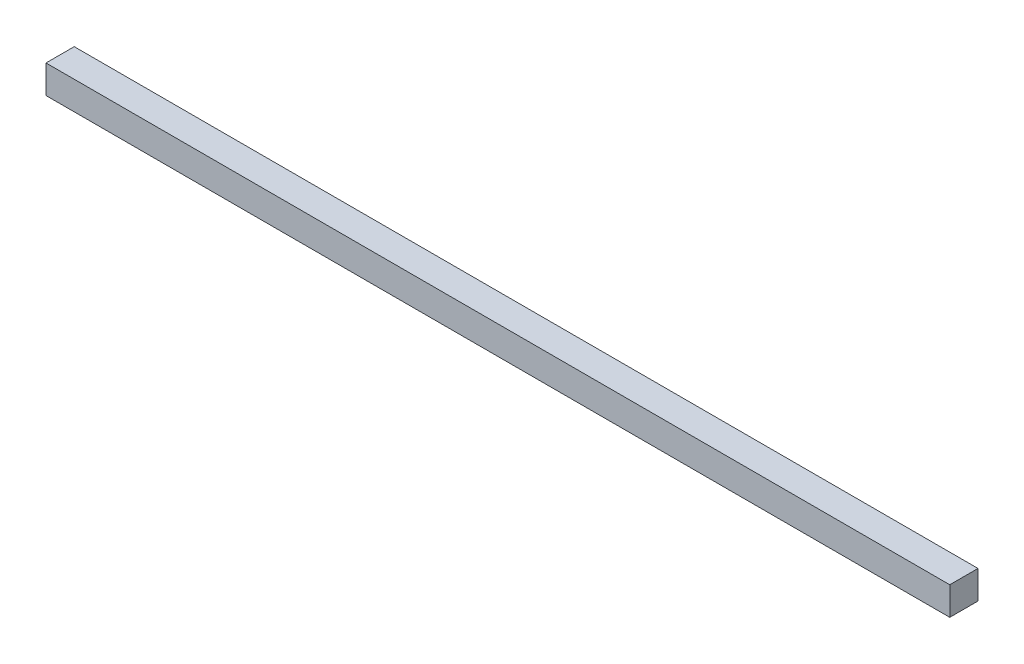
ISO-10303-21;
HEADER;
FILE_DESCRIPTION(('STEP AP214'),'2;1');
FILE_NAME('part.step','',(''),(''),'','','');
FILE_SCHEMA(('AUTOMOTIVE_DESIGN { 1 0 10303 214 1 1 1 1 }'));
ENDSEC;
DATA;
#1=APPLICATION_CONTEXT('core data for automotive mechanical design processes');
#2=APPLICATION_PROTOCOL_DEFINITION('international standard','automotive_design',2000,#1);
#3=PRODUCT_CONTEXT('',#1,'mechanical');
#4=PRODUCT('Part','Part','',(#3));
#5=PRODUCT_RELATED_PRODUCT_CATEGORY('part','',(#4));
#6=PRODUCT_DEFINITION_FORMATION('','',#4);
#7=PRODUCT_DEFINITION_CONTEXT('part definition',#1,'design');
#8=PRODUCT_DEFINITION('design','',#6,#7);
#9=PRODUCT_DEFINITION_SHAPE('','',#8);
#10=(LENGTH_UNIT() NAMED_UNIT(*) SI_UNIT(.MILLI.,.METRE.));
#11=(NAMED_UNIT(*) PLANE_ANGLE_UNIT() SI_UNIT($,.RADIAN.));
#12=(NAMED_UNIT(*) SI_UNIT($,.STERADIAN.) SOLID_ANGLE_UNIT());
#13=UNCERTAINTY_MEASURE_WITH_UNIT(LENGTH_MEASURE(1.E-05),#10,'distance_accuracy_value','');
#14=(GEOMETRIC_REPRESENTATION_CONTEXT(3) GLOBAL_UNCERTAINTY_ASSIGNED_CONTEXT((#13)) GLOBAL_UNIT_ASSIGNED_CONTEXT((#10,
#11,#12)) REPRESENTATION_CONTEXT('',''));
#15=CARTESIAN_POINT('',(0.,0.,0.));
#16=DIRECTION('',(0.,0.,1.));
#17=DIRECTION('',(1.,0.,0.));
#18=AXIS2_PLACEMENT_3D('',#15,#16,#17);
#19=CARTESIAN_POINT('',(-609.6,-19.05,-19.05));
#20=DIRECTION('',(0.,0.,-1.));
#21=DIRECTION('',(-1.,0.,0.));
#22=AXIS2_PLACEMENT_3D('',#19,#20,#21);
#23=PLANE('',#22);
#24=DIRECTION('',(1.,0.,0.));
#25=VECTOR('',#24,1.);
#26=CARTESIAN_POINT('',(-609.6,19.05,-19.05));
#27=LINE('',#26,#25);
#28=CARTESIAN_POINT('',(-609.6,19.05,-19.05));
#29=VERTEX_POINT('',#28);
#30=CARTESIAN_POINT('',(609.6,19.05,-19.05));
#31=VERTEX_POINT('',#30);
#32=EDGE_CURVE('E35',#29,#31,#27,.T.);
#33=ORIENTED_EDGE('',*,*,#32,.T.);
#34=DIRECTION('',(0.,1.,0.));
#35=VECTOR('',#34,1.);
#36=CARTESIAN_POINT('',(609.6,-19.05,-19.05));
#37=LINE('',#36,#35);
#38=CARTESIAN_POINT('',(609.6,-19.05,-19.05));
#39=VERTEX_POINT('',#38);
#40=EDGE_CURVE('E72',#39,#31,#37,.T.);
#41=ORIENTED_EDGE('',*,*,#40,.F.);
#42=DIRECTION('',(1.,0.,0.));
#43=VECTOR('',#42,1.);
#44=CARTESIAN_POINT('',(-609.6,-19.05,-19.05));
#45=LINE('',#44,#43);
#46=CARTESIAN_POINT('',(-609.6,-19.05,-19.05));
#47=VERTEX_POINT('',#46);
#48=EDGE_CURVE('E11',#47,#39,#45,.T.);
#49=ORIENTED_EDGE('',*,*,#48,.F.);
#50=DIRECTION('',(0.,1.,0.));
#51=VECTOR('',#50,1.);
#52=CARTESIAN_POINT('',(-609.6,-19.05,-19.05));
#53=LINE('',#52,#51);
#54=EDGE_CURVE('E73',#47,#29,#53,.T.);
#55=ORIENTED_EDGE('',*,*,#54,.T.);
#56=EDGE_LOOP('',(#33,#41,#49,#55));
#57=FACE_BOUND('',#56,.T.);
#58=ADVANCED_FACE('F32',(#57),#23,.T.);
#59=CARTESIAN_POINT('',(-609.6,-19.05,19.05));
#60=DIRECTION('',(0.,-1.,0.));
#61=DIRECTION('',(0.,0.,-1.));
#62=AXIS2_PLACEMENT_3D('',#59,#60,#61);
#63=PLANE('',#62);
#64=ORIENTED_EDGE('',*,*,#48,.T.);
#65=DIRECTION('',(0.,0.,-1.));
#66=VECTOR('',#65,1.);
#67=CARTESIAN_POINT('',(609.6,-19.05,19.05));
#68=LINE('',#67,#66);
#69=CARTESIAN_POINT('',(609.6,-19.05,19.05));
#70=VERTEX_POINT('',#69);
#71=EDGE_CURVE('E89',#70,#39,#68,.T.);
#72=ORIENTED_EDGE('',*,*,#71,.F.);
#73=DIRECTION('',(1.,0.,0.));
#74=VECTOR('',#73,1.);
#75=CARTESIAN_POINT('',(-609.6,-19.05,19.05));
#76=LINE('',#75,#74);
#77=CARTESIAN_POINT('',(-609.6,-19.05,19.05));
#78=VERTEX_POINT('',#77);
#79=EDGE_CURVE('E40',#78,#70,#76,.T.);
#80=ORIENTED_EDGE('',*,*,#79,.F.);
#81=DIRECTION('',(0.,0.,-1.));
#82=VECTOR('',#81,1.);
#83=CARTESIAN_POINT('',(-609.6,-19.05,19.05));
#84=LINE('',#83,#82);
#85=EDGE_CURVE('E78',#78,#47,#84,.T.);
#86=ORIENTED_EDGE('',*,*,#85,.T.);
#87=EDGE_LOOP('',(#64,#72,#80,#86));
#88=FACE_BOUND('',#87,.T.);
#89=ADVANCED_FACE('F104',(#88),#63,.T.);
#90=CARTESIAN_POINT('',(-609.6,-19.05,19.05));
#91=DIRECTION('',(0.,0.,1.));
#92=DIRECTION('',(1.,0.,0.));
#93=AXIS2_PLACEMENT_3D('',#90,#91,#92);
#94=PLANE('',#93);
#95=ORIENTED_EDGE('',*,*,#79,.T.);
#96=DIRECTION('',(0.,-1.,0.));
#97=VECTOR('',#96,1.);
#98=CARTESIAN_POINT('',(609.6,-19.05,19.05));
#99=LINE('',#98,#97);
#100=CARTESIAN_POINT('',(609.6,19.05,19.05));
#101=VERTEX_POINT('',#100);
#102=EDGE_CURVE('E85',#101,#70,#99,.T.);
#103=ORIENTED_EDGE('',*,*,#102,.F.);
#104=DIRECTION('',(1.,0.,0.));
#105=VECTOR('',#104,1.);
#106=CARTESIAN_POINT('',(-609.6,19.05,19.05));
#107=LINE('',#106,#105);
#108=CARTESIAN_POINT('',(-609.6,19.05,19.05));
#109=VERTEX_POINT('',#108);
#110=EDGE_CURVE('E77',#109,#101,#107,.T.);
#111=ORIENTED_EDGE('',*,*,#110,.F.);
#112=DIRECTION('',(0.,-1.,0.));
#113=VECTOR('',#112,1.);
#114=CARTESIAN_POINT('',(-609.6,-19.05,19.05));
#115=LINE('',#114,#113);
#116=EDGE_CURVE('E97',#109,#78,#115,.T.);
#117=ORIENTED_EDGE('',*,*,#116,.T.);
#118=EDGE_LOOP('',(#95,#103,#111,#117));
#119=FACE_BOUND('',#118,.T.);
#120=ADVANCED_FACE('F101',(#119),#94,.T.);
#121=CARTESIAN_POINT('',(-609.6,19.05,19.05));
#122=DIRECTION('',(0.,1.,0.));
#123=DIRECTION('',(0.,0.,1.));
#124=AXIS2_PLACEMENT_3D('',#121,#122,#123);
#125=PLANE('',#124);
#126=ORIENTED_EDGE('',*,*,#110,.T.);
#127=DIRECTION('',(0.,0.,1.));
#128=VECTOR('',#127,1.);
#129=CARTESIAN_POINT('',(609.6,19.05,19.05));
#130=LINE('',#129,#128);
#131=EDGE_CURVE('E80',#31,#101,#130,.T.);
#132=ORIENTED_EDGE('',*,*,#131,.F.);
#133=ORIENTED_EDGE('',*,*,#32,.F.);
#134=DIRECTION('',(0.,0.,1.));
#135=VECTOR('',#134,1.);
#136=CARTESIAN_POINT('',(-609.6,19.05,19.05));
#137=LINE('',#136,#135);
#138=EDGE_CURVE('E95',#29,#109,#137,.T.);
#139=ORIENTED_EDGE('',*,*,#138,.T.);
#140=EDGE_LOOP('',(#126,#132,#133,#139));
#141=FACE_BOUND('',#140,.T.);
#142=ADVANCED_FACE('F81',(#141),#125,.T.);
#143=CARTESIAN_POINT('',(-609.6,0.,0.));
#144=DIRECTION('',(-1.,0.,0.));
#145=DIRECTION('',(0.,0.,1.));
#146=AXIS2_PLACEMENT_3D('',#143,#144,#145);
#147=PLANE('',#146);
#148=ORIENTED_EDGE('',*,*,#54,.F.);
#149=ORIENTED_EDGE('',*,*,#85,.F.);
#150=ORIENTED_EDGE('',*,*,#116,.F.);
#151=ORIENTED_EDGE('',*,*,#138,.F.);
#152=EDGE_LOOP('',(#148,#149,#150,#151));
#153=FACE_BOUND('',#152,.T.);
#154=ADVANCED_FACE('F106',(#153),#147,.T.);
#155=CARTESIAN_POINT('',(609.6,0.,0.));
#156=DIRECTION('',(-1.,0.,0.));
#157=DIRECTION('',(0.,0.,1.));
#158=AXIS2_PLACEMENT_3D('',#155,#156,#157);
#159=PLANE('',#158);
#160=ORIENTED_EDGE('',*,*,#40,.T.);
#161=ORIENTED_EDGE('',*,*,#131,.T.);
#162=ORIENTED_EDGE('',*,*,#102,.T.);
#163=ORIENTED_EDGE('',*,*,#71,.T.);
#164=EDGE_LOOP('',(#160,#161,#162,#163));
#165=FACE_BOUND('',#164,.T.);
#166=ADVANCED_FACE('F88',(#165),#159,.F.);
#167=CLOSED_SHELL('',(#58,#89,#120,#142,#154,#166));
#168=MANIFOLD_SOLID_BREP('B2',#167);
#169=ADVANCED_BREP_SHAPE_REPRESENTATION('',(#18,#168),#14);
#170=SHAPE_DEFINITION_REPRESENTATION(#9,#169);
ENDSEC;
END-ISO-10303-21;
